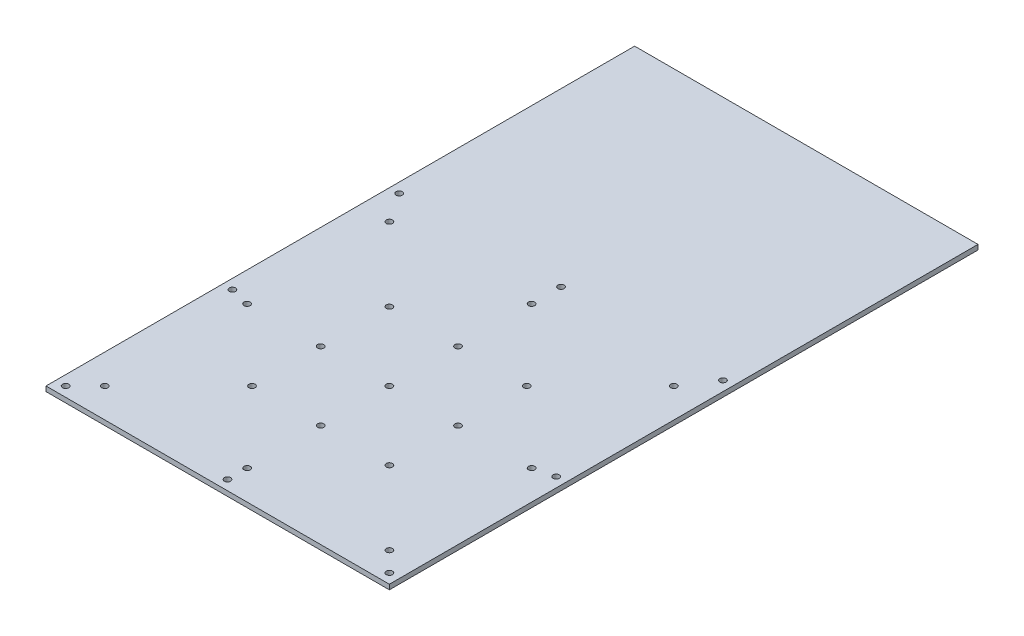
ISO-10303-21;
HEADER;
FILE_DESCRIPTION(('STEP AP214'),'2;1');
FILE_NAME('part.step','',(''),(''),'','','');
FILE_SCHEMA(('AUTOMOTIVE_DESIGN { 1 0 10303 214 1 1 1 1 }'));
ENDSEC;
DATA;
#1=APPLICATION_CONTEXT('core data for automotive mechanical design processes');
#2=APPLICATION_PROTOCOL_DEFINITION('international standard','automotive_design',2000,#1);
#3=PRODUCT_CONTEXT('',#1,'mechanical');
#4=PRODUCT('Part','Part','',(#3));
#5=PRODUCT_RELATED_PRODUCT_CATEGORY('part','',(#4));
#6=PRODUCT_DEFINITION_FORMATION('','',#4);
#7=PRODUCT_DEFINITION_CONTEXT('part definition',#1,'design');
#8=PRODUCT_DEFINITION('design','',#6,#7);
#9=PRODUCT_DEFINITION_SHAPE('','',#8);
#10=(LENGTH_UNIT() NAMED_UNIT(*) SI_UNIT(.MILLI.,.METRE.));
#11=(NAMED_UNIT(*) PLANE_ANGLE_UNIT() SI_UNIT($,.RADIAN.));
#12=(NAMED_UNIT(*) SI_UNIT($,.STERADIAN.) SOLID_ANGLE_UNIT());
#13=UNCERTAINTY_MEASURE_WITH_UNIT(LENGTH_MEASURE(1.E-05),#10,'distance_accuracy_value','');
#14=(GEOMETRIC_REPRESENTATION_CONTEXT(3) GLOBAL_UNCERTAINTY_ASSIGNED_CONTEXT((#13)) GLOBAL_UNIT_ASSIGNED_CONTEXT((#10,
#11,#12)) REPRESENTATION_CONTEXT('',''));
#15=CARTESIAN_POINT('',(0.,0.,0.));
#16=DIRECTION('',(0.,0.,1.));
#17=DIRECTION('',(1.,0.,0.));
#18=AXIS2_PLACEMENT_3D('',#15,#16,#17);
#19=CARTESIAN_POINT('',(0.,5.,-600.));
#20=DIRECTION('',(0.,0.,1.));
#21=DIRECTION('',(1.,0.,0.));
#22=AXIS2_PLACEMENT_3D('',#19,#20,#21);
#23=PLANE('',#22);
#24=DIRECTION('',(-1.,0.,0.));
#25=VECTOR('',#24,1.);
#26=CARTESIAN_POINT('',(0.,0.,-600.));
#27=LINE('',#26,#25);
#28=CARTESIAN_POINT('',(350.,0.,-600.));
#29=VERTEX_POINT('',#28);
#30=CARTESIAN_POINT('',(0.,0.,-600.));
#31=VERTEX_POINT('',#30);
#32=EDGE_CURVE('E175',#29,#31,#27,.T.);
#33=ORIENTED_EDGE('',*,*,#32,.T.);
#34=DIRECTION('',(0.,-1.,0.));
#35=VECTOR('',#34,1.);
#36=CARTESIAN_POINT('',(0.,5.,-600.));
#37=LINE('',#36,#35);
#38=CARTESIAN_POINT('',(0.,5.,-600.));
#39=VERTEX_POINT('',#38);
#40=EDGE_CURVE('E11',#39,#31,#37,.T.);
#41=ORIENTED_EDGE('',*,*,#40,.F.);
#42=DIRECTION('',(-1.,0.,0.));
#43=VECTOR('',#42,1.);
#44=CARTESIAN_POINT('',(0.,5.,-600.));
#45=LINE('',#44,#43);
#46=CARTESIAN_POINT('',(350.,5.,-600.));
#47=VERTEX_POINT('',#46);
#48=EDGE_CURVE('E88',#47,#39,#45,.T.);
#49=ORIENTED_EDGE('',*,*,#48,.F.);
#50=DIRECTION('',(0.,-1.,0.));
#51=VECTOR('',#50,1.);
#52=CARTESIAN_POINT('',(350.,5.,-600.));
#53=LINE('',#52,#51);
#54=EDGE_CURVE('E126',#47,#29,#53,.T.);
#55=ORIENTED_EDGE('',*,*,#54,.T.);
#56=EDGE_LOOP('',(#33,#41,#49,#55));
#57=FACE_BOUND('',#56,.T.);
#58=ADVANCED_FACE('F35',(#57),#23,.F.);
#59=CARTESIAN_POINT('',(0.,5.,0.));
#60=DIRECTION('',(1.,0.,0.));
#61=DIRECTION('',(0.,0.,-1.));
#62=AXIS2_PLACEMENT_3D('',#59,#60,#61);
#63=PLANE('',#62);
#64=DIRECTION('',(0.,0.,1.));
#65=VECTOR('',#64,1.);
#66=CARTESIAN_POINT('',(0.,0.,0.));
#67=LINE('',#66,#65);
#68=CARTESIAN_POINT('',(0.,0.,0.));
#69=VERTEX_POINT('',#68);
#70=EDGE_CURVE('E92',#31,#69,#67,.T.);
#71=ORIENTED_EDGE('',*,*,#70,.T.);
#72=DIRECTION('',(0.,-1.,0.));
#73=VECTOR('',#72,1.);
#74=CARTESIAN_POINT('',(0.,5.,0.));
#75=LINE('',#74,#73);
#76=CARTESIAN_POINT('',(0.,5.,0.));
#77=VERTEX_POINT('',#76);
#78=EDGE_CURVE('E44',#77,#69,#75,.T.);
#79=ORIENTED_EDGE('',*,*,#78,.F.);
#80=DIRECTION('',(0.,0.,1.));
#81=VECTOR('',#80,1.);
#82=CARTESIAN_POINT('',(0.,5.,0.));
#83=LINE('',#82,#81);
#84=EDGE_CURVE('E82',#39,#77,#83,.T.);
#85=ORIENTED_EDGE('',*,*,#84,.F.);
#86=ORIENTED_EDGE('',*,*,#40,.T.);
#87=EDGE_LOOP('',(#71,#79,#85,#86));
#88=FACE_BOUND('',#87,.T.);
#89=ADVANCED_FACE('F91',(#88),#63,.F.);
#90=CARTESIAN_POINT('',(0.,5.,0.));
#91=DIRECTION('',(0.,0.,-1.));
#92=DIRECTION('',(-1.,0.,0.));
#93=AXIS2_PLACEMENT_3D('',#90,#91,#92);
#94=PLANE('',#93);
#95=DIRECTION('',(1.,0.,0.));
#96=VECTOR('',#95,1.);
#97=CARTESIAN_POINT('',(0.,0.,0.));
#98=LINE('',#97,#96);
#99=CARTESIAN_POINT('',(350.,0.,0.));
#100=VERTEX_POINT('',#99);
#101=EDGE_CURVE('E69',#69,#100,#98,.T.);
#102=ORIENTED_EDGE('',*,*,#101,.T.);
#103=DIRECTION('',(0.,-1.,0.));
#104=VECTOR('',#103,1.);
#105=CARTESIAN_POINT('',(350.,5.,0.));
#106=LINE('',#105,#104);
#107=CARTESIAN_POINT('',(350.,5.,0.));
#108=VERTEX_POINT('',#107);
#109=EDGE_CURVE('E93',#108,#100,#106,.T.);
#110=ORIENTED_EDGE('',*,*,#109,.F.);
#111=DIRECTION('',(1.,0.,0.));
#112=VECTOR('',#111,1.);
#113=CARTESIAN_POINT('',(0.,5.,0.));
#114=LINE('',#113,#112);
#115=EDGE_CURVE('E86',#77,#108,#114,.T.);
#116=ORIENTED_EDGE('',*,*,#115,.F.);
#117=ORIENTED_EDGE('',*,*,#78,.T.);
#118=EDGE_LOOP('',(#102,#110,#116,#117));
#119=FACE_BOUND('',#118,.T.);
#120=ADVANCED_FACE('F94',(#119),#94,.F.);
#121=CARTESIAN_POINT('',(175.,5.,-245.));
#122=DIRECTION('',(0.,-1.,0.));
#123=DIRECTION('',(0.,0.,-1.));
#124=AXIS2_PLACEMENT_3D('',#121,#122,#123);
#125=CYLINDRICAL_SURFACE('',#124,3.17499999999997);
#126=CARTESIAN_POINT('',(175.,5.,-245.));
#127=DIRECTION('',(0.,1.,0.));
#128=DIRECTION('',(0.,0.,1.));
#129=AXIS2_PLACEMENT_3D('',#126,#127,#128);
#130=CIRCLE('',#129,3.17499999999997);
#131=CARTESIAN_POINT('',(175.,5.,-241.825));
#132=VERTEX_POINT('',#131);
#133=EDGE_CURVE('E120',#132,#132,#130,.T.);
#134=ORIENTED_EDGE('',*,*,#133,.T.);
#135=EDGE_LOOP('',(#134));
#136=FACE_BOUND('',#135,.T.);
#137=CARTESIAN_POINT('',(175.,0.,-245.));
#138=DIRECTION('',(0.,1.,0.));
#139=DIRECTION('',(0.,0.,1.));
#140=AXIS2_PLACEMENT_3D('',#137,#138,#139);
#141=CIRCLE('',#140,3.17499999999997);
#142=CARTESIAN_POINT('',(175.,0.,-241.825));
#143=VERTEX_POINT('',#142);
#144=EDGE_CURVE('E202',#143,#143,#141,.T.);
#145=ORIENTED_EDGE('',*,*,#144,.F.);
#146=EDGE_LOOP('',(#145));
#147=FACE_BOUND('',#146,.T.);
#148=ADVANCED_FACE('F428',(#136,#147),#125,.F.);
#149=CARTESIAN_POINT('',(245.,5.,-245.));
#150=DIRECTION('',(0.,-1.,0.));
#151=DIRECTION('',(0.,0.,-1.));
#152=AXIS2_PLACEMENT_3D('',#149,#150,#151);
#153=CYLINDRICAL_SURFACE('',#152,3.17499999999997);
#154=CARTESIAN_POINT('',(245.,5.,-245.));
#155=DIRECTION('',(0.,1.,0.));
#156=DIRECTION('',(0.,0.,1.));
#157=AXIS2_PLACEMENT_3D('',#154,#155,#156);
#158=CIRCLE('',#157,3.17499999999997);
#159=CARTESIAN_POINT('',(245.,5.,-241.825));
#160=VERTEX_POINT('',#159);
#161=EDGE_CURVE('E117',#160,#160,#158,.T.);
#162=ORIENTED_EDGE('',*,*,#161,.T.);
#163=EDGE_LOOP('',(#162));
#164=FACE_BOUND('',#163,.T.);
#165=CARTESIAN_POINT('',(245.,0.,-245.));
#166=DIRECTION('',(0.,1.,0.));
#167=DIRECTION('',(0.,0.,1.));
#168=AXIS2_PLACEMENT_3D('',#165,#166,#167);
#169=CIRCLE('',#168,3.17499999999997);
#170=CARTESIAN_POINT('',(245.,0.,-241.825));
#171=VERTEX_POINT('',#170);
#172=EDGE_CURVE('E199',#171,#171,#169,.T.);
#173=ORIENTED_EDGE('',*,*,#172,.F.);
#174=EDGE_LOOP('',(#173));
#175=FACE_BOUND('',#174,.T.);
#176=ADVANCED_FACE('F431',(#164,#175),#153,.F.);
#177=CARTESIAN_POINT('',(175.,5.,-175.));
#178=DIRECTION('',(0.,-1.,0.));
#179=DIRECTION('',(0.,0.,-1.));
#180=AXIS2_PLACEMENT_3D('',#177,#178,#179);
#181=CYLINDRICAL_SURFACE('',#180,3.175);
#182=CARTESIAN_POINT('',(175.,5.,-175.));
#183=DIRECTION('',(0.,1.,0.));
#184=DIRECTION('',(0.,0.,1.));
#185=AXIS2_PLACEMENT_3D('',#182,#183,#184);
#186=CIRCLE('',#185,3.175);
#187=CARTESIAN_POINT('',(175.,5.,-171.825));
#188=VERTEX_POINT('',#187);
#189=EDGE_CURVE('E114',#188,#188,#186,.T.);
#190=ORIENTED_EDGE('',*,*,#189,.T.);
#191=EDGE_LOOP('',(#190));
#192=FACE_BOUND('',#191,.T.);
#193=CARTESIAN_POINT('',(175.,0.,-175.));
#194=DIRECTION('',(0.,1.,0.));
#195=DIRECTION('',(0.,0.,1.));
#196=AXIS2_PLACEMENT_3D('',#193,#194,#195);
#197=CIRCLE('',#196,3.175);
#198=CARTESIAN_POINT('',(175.,0.,-171.825));
#199=VERTEX_POINT('',#198);
#200=EDGE_CURVE('E196',#199,#199,#197,.T.);
#201=ORIENTED_EDGE('',*,*,#200,.F.);
#202=EDGE_LOOP('',(#201));
#203=FACE_BOUND('',#202,.T.);
#204=ADVANCED_FACE('F435',(#192,#203),#181,.F.);
#205=CARTESIAN_POINT('',(245.,5.,-175.));
#206=DIRECTION('',(0.,-1.,0.));
#207=DIRECTION('',(0.,0.,-1.));
#208=AXIS2_PLACEMENT_3D('',#205,#206,#207);
#209=CYLINDRICAL_SURFACE('',#208,3.17499999999997);
#210=CARTESIAN_POINT('',(245.,5.,-175.));
#211=DIRECTION('',(0.,1.,0.));
#212=DIRECTION('',(0.,0.,1.));
#213=AXIS2_PLACEMENT_3D('',#210,#211,#212);
#214=CIRCLE('',#213,3.17499999999997);
#215=CARTESIAN_POINT('',(245.,5.,-171.825));
#216=VERTEX_POINT('',#215);
#217=EDGE_CURVE('E111',#216,#216,#214,.T.);
#218=ORIENTED_EDGE('',*,*,#217,.T.);
#219=EDGE_LOOP('',(#218));
#220=FACE_BOUND('',#219,.T.);
#221=CARTESIAN_POINT('',(245.,0.,-175.));
#222=DIRECTION('',(0.,1.,0.));
#223=DIRECTION('',(0.,0.,1.));
#224=AXIS2_PLACEMENT_3D('',#221,#222,#223);
#225=CIRCLE('',#224,3.17499999999997);
#226=CARTESIAN_POINT('',(245.,0.,-171.825));
#227=VERTEX_POINT('',#226);
#228=EDGE_CURVE('E193',#227,#227,#225,.T.);
#229=ORIENTED_EDGE('',*,*,#228,.F.);
#230=EDGE_LOOP('',(#229));
#231=FACE_BOUND('',#230,.T.);
#232=ADVANCED_FACE('F439',(#220,#231),#209,.F.);
#233=CARTESIAN_POINT('',(105.,5.,-175.));
#234=DIRECTION('',(0.,-1.,0.));
#235=DIRECTION('',(0.,0.,-1.));
#236=AXIS2_PLACEMENT_3D('',#233,#234,#235);
#237=CYLINDRICAL_SURFACE('',#236,3.17499999999997);
#238=CARTESIAN_POINT('',(105.,5.,-175.));
#239=DIRECTION('',(0.,1.,0.));
#240=DIRECTION('',(0.,0.,1.));
#241=AXIS2_PLACEMENT_3D('',#238,#239,#240);
#242=CIRCLE('',#241,3.17499999999997);
#243=CARTESIAN_POINT('',(105.,5.,-171.825));
#244=VERTEX_POINT('',#243);
#245=EDGE_CURVE('E108',#244,#244,#242,.T.);
#246=ORIENTED_EDGE('',*,*,#245,.T.);
#247=EDGE_LOOP('',(#246));
#248=FACE_BOUND('',#247,.T.);
#249=CARTESIAN_POINT('',(105.,0.,-175.));
#250=DIRECTION('',(0.,1.,0.));
#251=DIRECTION('',(0.,0.,1.));
#252=AXIS2_PLACEMENT_3D('',#249,#250,#251);
#253=CIRCLE('',#252,3.17499999999997);
#254=CARTESIAN_POINT('',(105.,0.,-171.825));
#255=VERTEX_POINT('',#254);
#256=EDGE_CURVE('E190',#255,#255,#253,.T.);
#257=ORIENTED_EDGE('',*,*,#256,.F.);
#258=EDGE_LOOP('',(#257));
#259=FACE_BOUND('',#258,.T.);
#260=ADVANCED_FACE('F443',(#248,#259),#237,.F.);
#261=CARTESIAN_POINT('',(105.,5.,-105.));
#262=DIRECTION('',(0.,-1.,0.));
#263=DIRECTION('',(0.,0.,-1.));
#264=AXIS2_PLACEMENT_3D('',#261,#262,#263);
#265=CYLINDRICAL_SURFACE('',#264,3.17499999999997);
#266=CARTESIAN_POINT('',(105.,5.,-105.));
#267=DIRECTION('',(0.,1.,0.));
#268=DIRECTION('',(0.,0.,1.));
#269=AXIS2_PLACEMENT_3D('',#266,#267,#268);
#270=CIRCLE('',#269,3.17499999999997);
#271=CARTESIAN_POINT('',(105.,5.,-101.825));
#272=VERTEX_POINT('',#271);
#273=EDGE_CURVE('E105',#272,#272,#270,.T.);
#274=ORIENTED_EDGE('',*,*,#273,.T.);
#275=EDGE_LOOP('',(#274));
#276=FACE_BOUND('',#275,.T.);
#277=CARTESIAN_POINT('',(105.,0.,-105.));
#278=DIRECTION('',(0.,1.,0.));
#279=DIRECTION('',(0.,0.,1.));
#280=AXIS2_PLACEMENT_3D('',#277,#278,#279);
#281=CIRCLE('',#280,3.17499999999997);
#282=CARTESIAN_POINT('',(105.,0.,-101.825));
#283=VERTEX_POINT('',#282);
#284=EDGE_CURVE('E187',#283,#283,#281,.T.);
#285=ORIENTED_EDGE('',*,*,#284,.F.);
#286=EDGE_LOOP('',(#285));
#287=FACE_BOUND('',#286,.T.);
#288=ADVANCED_FACE('F447',(#276,#287),#265,.F.);
#289=CARTESIAN_POINT('',(175.,5.,-105.));
#290=DIRECTION('',(0.,-1.,0.));
#291=DIRECTION('',(0.,0.,-1.));
#292=AXIS2_PLACEMENT_3D('',#289,#290,#291);
#293=CYLINDRICAL_SURFACE('',#292,3.17499999999997);
#294=CARTESIAN_POINT('',(175.,5.,-105.));
#295=DIRECTION('',(0.,1.,0.));
#296=DIRECTION('',(0.,0.,1.));
#297=AXIS2_PLACEMENT_3D('',#294,#295,#296);
#298=CIRCLE('',#297,3.17499999999997);
#299=CARTESIAN_POINT('',(175.,5.,-101.825));
#300=VERTEX_POINT('',#299);
#301=EDGE_CURVE('E102',#300,#300,#298,.T.);
#302=ORIENTED_EDGE('',*,*,#301,.T.);
#303=EDGE_LOOP('',(#302));
#304=FACE_BOUND('',#303,.T.);
#305=CARTESIAN_POINT('',(175.,0.,-105.));
#306=DIRECTION('',(0.,1.,0.));
#307=DIRECTION('',(0.,0.,1.));
#308=AXIS2_PLACEMENT_3D('',#305,#306,#307);
#309=CIRCLE('',#308,3.17499999999997);
#310=CARTESIAN_POINT('',(175.,0.,-101.825));
#311=VERTEX_POINT('',#310);
#312=EDGE_CURVE('E184',#311,#311,#309,.T.);
#313=ORIENTED_EDGE('',*,*,#312,.F.);
#314=EDGE_LOOP('',(#313));
#315=FACE_BOUND('',#314,.T.);
#316=ADVANCED_FACE('F451',(#304,#315),#293,.F.);
#317=CARTESIAN_POINT('',(245.,5.,-105.));
#318=DIRECTION('',(0.,-1.,0.));
#319=DIRECTION('',(0.,0.,-1.));
#320=AXIS2_PLACEMENT_3D('',#317,#318,#319);
#321=CYLINDRICAL_SURFACE('',#320,3.17499999999997);
#322=CARTESIAN_POINT('',(245.,5.,-105.));
#323=DIRECTION('',(0.,1.,0.));
#324=DIRECTION('',(0.,0.,1.));
#325=AXIS2_PLACEMENT_3D('',#322,#323,#324);
#326=CIRCLE('',#325,3.17499999999997);
#327=CARTESIAN_POINT('',(245.,5.,-101.825));
#328=VERTEX_POINT('',#327);
#329=EDGE_CURVE('E96',#328,#328,#326,.T.);
#330=ORIENTED_EDGE('',*,*,#329,.T.);
#331=EDGE_LOOP('',(#330));
#332=FACE_BOUND('',#331,.T.);
#333=CARTESIAN_POINT('',(245.,0.,-105.));
#334=DIRECTION('',(0.,1.,0.));
#335=DIRECTION('',(0.,0.,1.));
#336=AXIS2_PLACEMENT_3D('',#333,#334,#335);
#337=CIRCLE('',#336,3.17499999999997);
#338=CARTESIAN_POINT('',(245.,0.,-101.825));
#339=VERTEX_POINT('',#338);
#340=EDGE_CURVE('E181',#339,#339,#337,.T.);
#341=ORIENTED_EDGE('',*,*,#340,.F.);
#342=EDGE_LOOP('',(#341));
#343=FACE_BOUND('',#342,.T.);
#344=ADVANCED_FACE('F455',(#332,#343),#321,.F.);
#345=CARTESIAN_POINT('',(350.,5.,0.));
#346=DIRECTION('',(-1.,0.,0.));
#347=DIRECTION('',(0.,0.,1.));
#348=AXIS2_PLACEMENT_3D('',#345,#346,#347);
#349=PLANE('',#348);
#350=DIRECTION('',(0.,0.,-1.));
#351=VECTOR('',#350,1.);
#352=CARTESIAN_POINT('',(350.,0.,0.));
#353=LINE('',#352,#351);
#354=EDGE_CURVE('E75',#100,#29,#353,.T.);
#355=ORIENTED_EDGE('',*,*,#354,.T.);
#356=ORIENTED_EDGE('',*,*,#54,.F.);
#357=DIRECTION('',(0.,0.,-1.));
#358=VECTOR('',#357,1.);
#359=CARTESIAN_POINT('',(350.,5.,0.));
#360=LINE('',#359,#358);
#361=EDGE_CURVE('E52',#108,#47,#360,.T.);
#362=ORIENTED_EDGE('',*,*,#361,.F.);
#363=ORIENTED_EDGE('',*,*,#109,.T.);
#364=EDGE_LOOP('',(#355,#356,#362,#363));
#365=FACE_BOUND('',#364,.T.);
#366=ADVANCED_FACE('F210',(#365),#349,.F.);
#367=CARTESIAN_POINT('',(10.0000000000001,5.,-9.99999999999996));
#368=DIRECTION('',(0.,-1.,0.));
#369=DIRECTION('',(0.,0.,-1.));
#370=AXIS2_PLACEMENT_3D('',#367,#368,#369);
#371=CYLINDRICAL_SURFACE('',#370,3.175);
#372=CARTESIAN_POINT('',(10.0000000000001,5.,-9.99999999999996));
#373=DIRECTION('',(0.,1.,0.));
#374=DIRECTION('',(0.,0.,1.));
#375=AXIS2_PLACEMENT_3D('',#372,#373,#374);
#376=CIRCLE('',#375,3.175);
#377=CARTESIAN_POINT('',(10.0000000000001,5.,-6.82499999999996));
#378=VERTEX_POINT('',#377);
#379=EDGE_CURVE('E216',#378,#378,#376,.T.);
#380=ORIENTED_EDGE('',*,*,#379,.T.);
#381=EDGE_LOOP('',(#380));
#382=FACE_BOUND('',#381,.T.);
#383=CARTESIAN_POINT('',(10.0000000000001,0.,-9.99999999999996));
#384=DIRECTION('',(0.,1.,0.));
#385=DIRECTION('',(0.,0.,1.));
#386=AXIS2_PLACEMENT_3D('',#383,#384,#385);
#387=CIRCLE('',#386,3.175);
#388=CARTESIAN_POINT('',(10.0000000000001,0.,-6.82499999999996));
#389=VERTEX_POINT('',#388);
#390=EDGE_CURVE('E172',#389,#389,#387,.T.);
#391=ORIENTED_EDGE('',*,*,#390,.F.);
#392=EDGE_LOOP('',(#391));
#393=FACE_BOUND('',#392,.T.);
#394=ADVANCED_FACE('F301',(#382,#393),#371,.F.);
#395=CARTESIAN_POINT('',(175.,5.,-9.99999999999998));
#396=DIRECTION('',(0.,-1.,0.));
#397=DIRECTION('',(0.,0.,-1.));
#398=AXIS2_PLACEMENT_3D('',#395,#396,#397);
#399=CYLINDRICAL_SURFACE('',#398,3.175);
#400=CARTESIAN_POINT('',(175.,5.,-9.99999999999998));
#401=DIRECTION('',(0.,1.,0.));
#402=DIRECTION('',(0.,0.,1.));
#403=AXIS2_PLACEMENT_3D('',#400,#401,#402);
#404=CIRCLE('',#403,3.175);
#405=CARTESIAN_POINT('',(175.,5.,-6.82499999999998));
#406=VERTEX_POINT('',#405);
#407=EDGE_CURVE('E218',#406,#406,#404,.T.);
#408=ORIENTED_EDGE('',*,*,#407,.T.);
#409=EDGE_LOOP('',(#408));
#410=FACE_BOUND('',#409,.T.);
#411=CARTESIAN_POINT('',(175.,0.,-9.99999999999998));
#412=DIRECTION('',(0.,1.,0.));
#413=DIRECTION('',(0.,0.,1.));
#414=AXIS2_PLACEMENT_3D('',#411,#412,#413);
#415=CIRCLE('',#414,3.175);
#416=CARTESIAN_POINT('',(175.,0.,-6.82499999999998));
#417=VERTEX_POINT('',#416);
#418=EDGE_CURVE('E169',#417,#417,#415,.T.);
#419=ORIENTED_EDGE('',*,*,#418,.F.);
#420=EDGE_LOOP('',(#419));
#421=FACE_BOUND('',#420,.T.);
#422=ADVANCED_FACE('F304',(#410,#421),#399,.F.);
#423=CARTESIAN_POINT('',(340.,5.,-10.));
#424=DIRECTION('',(0.,-1.,0.));
#425=DIRECTION('',(0.,0.,-1.));
#426=AXIS2_PLACEMENT_3D('',#423,#424,#425);
#427=CYLINDRICAL_SURFACE('',#426,3.17499999999997);
#428=CARTESIAN_POINT('',(340.,5.,-10.));
#429=DIRECTION('',(0.,1.,0.));
#430=DIRECTION('',(0.,0.,1.));
#431=AXIS2_PLACEMENT_3D('',#428,#429,#430);
#432=CIRCLE('',#431,3.17499999999997);
#433=CARTESIAN_POINT('',(340.,5.,-6.82500000000003));
#434=VERTEX_POINT('',#433);
#435=EDGE_CURVE('E223',#434,#434,#432,.T.);
#436=ORIENTED_EDGE('',*,*,#435,.T.);
#437=EDGE_LOOP('',(#436));
#438=FACE_BOUND('',#437,.T.);
#439=CARTESIAN_POINT('',(340.,0.,-10.));
#440=DIRECTION('',(0.,1.,0.));
#441=DIRECTION('',(0.,0.,1.));
#442=AXIS2_PLACEMENT_3D('',#439,#440,#441);
#443=CIRCLE('',#442,3.17499999999997);
#444=CARTESIAN_POINT('',(340.,0.,-6.82500000000003));
#445=VERTEX_POINT('',#444);
#446=EDGE_CURVE('E166',#445,#445,#443,.T.);
#447=ORIENTED_EDGE('',*,*,#446,.F.);
#448=EDGE_LOOP('',(#447));
#449=FACE_BOUND('',#448,.T.);
#450=ADVANCED_FACE('F325',(#438,#449),#427,.F.);
#451=CARTESIAN_POINT('',(340.,5.,-350.));
#452=DIRECTION('',(0.,-1.,0.));
#453=DIRECTION('',(0.,0.,-1.));
#454=AXIS2_PLACEMENT_3D('',#451,#452,#453);
#455=CYLINDRICAL_SURFACE('',#454,3.17499999999997);
#456=CARTESIAN_POINT('',(340.,5.,-350.));
#457=DIRECTION('',(0.,1.,0.));
#458=DIRECTION('',(0.,0.,1.));
#459=AXIS2_PLACEMENT_3D('',#456,#457,#458);
#460=CIRCLE('',#459,3.17499999999997);
#461=CARTESIAN_POINT('',(340.,5.,-346.825));
#462=VERTEX_POINT('',#461);
#463=EDGE_CURVE('E226',#462,#462,#460,.T.);
#464=ORIENTED_EDGE('',*,*,#463,.T.);
#465=EDGE_LOOP('',(#464));
#466=FACE_BOUND('',#465,.T.);
#467=CARTESIAN_POINT('',(340.,0.,-350.));
#468=DIRECTION('',(0.,1.,0.));
#469=DIRECTION('',(0.,0.,1.));
#470=AXIS2_PLACEMENT_3D('',#467,#468,#469);
#471=CIRCLE('',#470,3.17499999999997);
#472=CARTESIAN_POINT('',(340.,0.,-346.825));
#473=VERTEX_POINT('',#472);
#474=EDGE_CURVE('E163',#473,#473,#471,.T.);
#475=ORIENTED_EDGE('',*,*,#474,.F.);
#476=EDGE_LOOP('',(#475));
#477=FACE_BOUND('',#476,.T.);
#478=ADVANCED_FACE('F329',(#466,#477),#455,.F.);
#479=CARTESIAN_POINT('',(340.,5.,-180.));
#480=DIRECTION('',(0.,-1.,0.));
#481=DIRECTION('',(0.,0.,-1.));
#482=AXIS2_PLACEMENT_3D('',#479,#480,#481);
#483=CYLINDRICAL_SURFACE('',#482,3.17499999999997);
#484=CARTESIAN_POINT('',(340.,5.,-180.));
#485=DIRECTION('',(0.,1.,0.));
#486=DIRECTION('',(0.,0.,1.));
#487=AXIS2_PLACEMENT_3D('',#484,#485,#486);
#488=CIRCLE('',#487,3.17499999999997);
#489=CARTESIAN_POINT('',(340.,5.,-176.825));
#490=VERTEX_POINT('',#489);
#491=EDGE_CURVE('E229',#490,#490,#488,.T.);
#492=ORIENTED_EDGE('',*,*,#491,.T.);
#493=EDGE_LOOP('',(#492));
#494=FACE_BOUND('',#493,.T.);
#495=CARTESIAN_POINT('',(340.,0.,-180.));
#496=DIRECTION('',(0.,1.,0.));
#497=DIRECTION('',(0.,0.,1.));
#498=AXIS2_PLACEMENT_3D('',#495,#496,#497);
#499=CIRCLE('',#498,3.17499999999997);
#500=CARTESIAN_POINT('',(340.,0.,-176.825));
#501=VERTEX_POINT('',#500);
#502=EDGE_CURVE('E160',#501,#501,#499,.T.);
#503=ORIENTED_EDGE('',*,*,#502,.F.);
#504=EDGE_LOOP('',(#503));
#505=FACE_BOUND('',#504,.T.);
#506=ADVANCED_FACE('F333',(#494,#505),#483,.F.);
#507=CARTESIAN_POINT('',(10.0000000000001,5.,-180.));
#508=DIRECTION('',(0.,-1.,0.));
#509=DIRECTION('',(0.,0.,-1.));
#510=AXIS2_PLACEMENT_3D('',#507,#508,#509);
#511=CYLINDRICAL_SURFACE('',#510,3.175);
#512=CARTESIAN_POINT('',(10.0000000000001,5.,-180.));
#513=DIRECTION('',(0.,1.,0.));
#514=DIRECTION('',(0.,0.,1.));
#515=AXIS2_PLACEMENT_3D('',#512,#513,#514);
#516=CIRCLE('',#515,3.175);
#517=CARTESIAN_POINT('',(10.0000000000001,5.,-176.825));
#518=VERTEX_POINT('',#517);
#519=EDGE_CURVE('E232',#518,#518,#516,.T.);
#520=ORIENTED_EDGE('',*,*,#519,.T.);
#521=EDGE_LOOP('',(#520));
#522=FACE_BOUND('',#521,.T.);
#523=CARTESIAN_POINT('',(10.0000000000001,0.,-180.));
#524=DIRECTION('',(0.,1.,0.));
#525=DIRECTION('',(0.,0.,1.));
#526=AXIS2_PLACEMENT_3D('',#523,#524,#525);
#527=CIRCLE('',#526,3.175);
#528=CARTESIAN_POINT('',(10.0000000000001,0.,-176.825));
#529=VERTEX_POINT('',#528);
#530=EDGE_CURVE('E157',#529,#529,#527,.T.);
#531=ORIENTED_EDGE('',*,*,#530,.F.);
#532=EDGE_LOOP('',(#531));
#533=FACE_BOUND('',#532,.T.);
#534=ADVANCED_FACE('F337',(#522,#533),#511,.F.);
#535=CARTESIAN_POINT('',(10.0000000000001,5.,-350.));
#536=DIRECTION('',(0.,-1.,0.));
#537=DIRECTION('',(0.,0.,-1.));
#538=AXIS2_PLACEMENT_3D('',#535,#536,#537);
#539=CYLINDRICAL_SURFACE('',#538,3.175);
#540=CARTESIAN_POINT('',(10.0000000000001,5.,-350.));
#541=DIRECTION('',(0.,1.,0.));
#542=DIRECTION('',(0.,0.,1.));
#543=AXIS2_PLACEMENT_3D('',#540,#541,#542);
#544=CIRCLE('',#543,3.175);
#545=CARTESIAN_POINT('',(10.0000000000001,5.,-346.825));
#546=VERTEX_POINT('',#545);
#547=EDGE_CURVE('E235',#546,#546,#544,.T.);
#548=ORIENTED_EDGE('',*,*,#547,.T.);
#549=EDGE_LOOP('',(#548));
#550=FACE_BOUND('',#549,.T.);
#551=CARTESIAN_POINT('',(10.0000000000001,0.,-350.));
#552=DIRECTION('',(0.,1.,0.));
#553=DIRECTION('',(0.,0.,1.));
#554=AXIS2_PLACEMENT_3D('',#551,#552,#553);
#555=CIRCLE('',#554,3.175);
#556=CARTESIAN_POINT('',(10.0000000000001,0.,-346.825));
#557=VERTEX_POINT('',#556);
#558=EDGE_CURVE('E154',#557,#557,#555,.T.);
#559=ORIENTED_EDGE('',*,*,#558,.F.);
#560=EDGE_LOOP('',(#559));
#561=FACE_BOUND('',#560,.T.);
#562=ADVANCED_FACE('F341',(#550,#561),#539,.F.);
#563=CARTESIAN_POINT('',(175.,5.,-350.));
#564=DIRECTION('',(0.,-1.,0.));
#565=DIRECTION('',(0.,0.,-1.));
#566=AXIS2_PLACEMENT_3D('',#563,#564,#565);
#567=CYLINDRICAL_SURFACE('',#566,3.175);
#568=CARTESIAN_POINT('',(175.,5.,-350.));
#569=DIRECTION('',(0.,1.,0.));
#570=DIRECTION('',(0.,0.,1.));
#571=AXIS2_PLACEMENT_3D('',#568,#569,#570);
#572=CIRCLE('',#571,3.175);
#573=CARTESIAN_POINT('',(175.,5.,-346.825));
#574=VERTEX_POINT('',#573);
#575=EDGE_CURVE('E238',#574,#574,#572,.T.);
#576=ORIENTED_EDGE('',*,*,#575,.T.);
#577=EDGE_LOOP('',(#576));
#578=FACE_BOUND('',#577,.T.);
#579=CARTESIAN_POINT('',(175.,0.,-350.));
#580=DIRECTION('',(0.,1.,0.));
#581=DIRECTION('',(0.,0.,1.));
#582=AXIS2_PLACEMENT_3D('',#579,#580,#581);
#583=CIRCLE('',#582,3.175);
#584=CARTESIAN_POINT('',(175.,0.,-346.825));
#585=VERTEX_POINT('',#584);
#586=EDGE_CURVE('E151',#585,#585,#583,.T.);
#587=ORIENTED_EDGE('',*,*,#586,.F.);
#588=EDGE_LOOP('',(#587));
#589=FACE_BOUND('',#588,.T.);
#590=ADVANCED_FACE('F345',(#578,#589),#567,.F.);
#591=CARTESIAN_POINT('',(320.,5.,-320.));
#592=DIRECTION('',(0.,-1.,0.));
#593=DIRECTION('',(0.,0.,-1.));
#594=AXIS2_PLACEMENT_3D('',#591,#592,#593);
#595=CYLINDRICAL_SURFACE('',#594,3.17499999999997);
#596=CARTESIAN_POINT('',(320.,5.,-320.));
#597=DIRECTION('',(0.,1.,0.));
#598=DIRECTION('',(0.,0.,1.));
#599=AXIS2_PLACEMENT_3D('',#596,#597,#598);
#600=CIRCLE('',#599,3.17499999999997);
#601=CARTESIAN_POINT('',(320.,5.,-316.825));
#602=VERTEX_POINT('',#601);
#603=EDGE_CURVE('E241',#602,#602,#600,.T.);
#604=ORIENTED_EDGE('',*,*,#603,.T.);
#605=EDGE_LOOP('',(#604));
#606=FACE_BOUND('',#605,.T.);
#607=CARTESIAN_POINT('',(320.,0.,-320.));
#608=DIRECTION('',(0.,1.,0.));
#609=DIRECTION('',(0.,0.,1.));
#610=AXIS2_PLACEMENT_3D('',#607,#608,#609);
#611=CIRCLE('',#610,3.17499999999997);
#612=CARTESIAN_POINT('',(320.,0.,-316.825));
#613=VERTEX_POINT('',#612);
#614=EDGE_CURVE('E148',#613,#613,#611,.T.);
#615=ORIENTED_EDGE('',*,*,#614,.F.);
#616=EDGE_LOOP('',(#615));
#617=FACE_BOUND('',#616,.T.);
#618=ADVANCED_FACE('F349',(#606,#617),#595,.F.);
#619=CARTESIAN_POINT('',(175.,5.,-320.));
#620=DIRECTION('',(0.,-1.,0.));
#621=DIRECTION('',(0.,0.,-1.));
#622=AXIS2_PLACEMENT_3D('',#619,#620,#621);
#623=CYLINDRICAL_SURFACE('',#622,3.17499999999997);
#624=CARTESIAN_POINT('',(175.,5.,-320.));
#625=DIRECTION('',(0.,1.,0.));
#626=DIRECTION('',(0.,0.,1.));
#627=AXIS2_PLACEMENT_3D('',#624,#625,#626);
#628=CIRCLE('',#627,3.17499999999997);
#629=CARTESIAN_POINT('',(175.,5.,-316.825));
#630=VERTEX_POINT('',#629);
#631=EDGE_CURVE('E244',#630,#630,#628,.T.);
#632=ORIENTED_EDGE('',*,*,#631,.T.);
#633=EDGE_LOOP('',(#632));
#634=FACE_BOUND('',#633,.T.);
#635=CARTESIAN_POINT('',(175.,0.,-320.));
#636=DIRECTION('',(0.,1.,0.));
#637=DIRECTION('',(0.,0.,1.));
#638=AXIS2_PLACEMENT_3D('',#635,#636,#637);
#639=CIRCLE('',#638,3.17499999999997);
#640=CARTESIAN_POINT('',(175.,0.,-316.825));
#641=VERTEX_POINT('',#640);
#642=EDGE_CURVE('E145',#641,#641,#639,.T.);
#643=ORIENTED_EDGE('',*,*,#642,.F.);
#644=EDGE_LOOP('',(#643));
#645=FACE_BOUND('',#644,.T.);
#646=ADVANCED_FACE('F353',(#634,#645),#623,.F.);
#647=CARTESIAN_POINT('',(29.9999999999999,5.,-320.));
#648=DIRECTION('',(0.,-1.,0.));
#649=DIRECTION('',(0.,0.,-1.));
#650=AXIS2_PLACEMENT_3D('',#647,#648,#649);
#651=CYLINDRICAL_SURFACE('',#650,3.175);
#652=CARTESIAN_POINT('',(29.9999999999999,5.,-320.));
#653=DIRECTION('',(0.,1.,0.));
#654=DIRECTION('',(0.,0.,1.));
#655=AXIS2_PLACEMENT_3D('',#652,#653,#654);
#656=CIRCLE('',#655,3.175);
#657=CARTESIAN_POINT('',(29.9999999999999,5.,-316.825));
#658=VERTEX_POINT('',#657);
#659=EDGE_CURVE('E247',#658,#658,#656,.T.);
#660=ORIENTED_EDGE('',*,*,#659,.T.);
#661=EDGE_LOOP('',(#660));
#662=FACE_BOUND('',#661,.T.);
#663=CARTESIAN_POINT('',(29.9999999999999,0.,-320.));
#664=DIRECTION('',(0.,1.,0.));
#665=DIRECTION('',(0.,0.,1.));
#666=AXIS2_PLACEMENT_3D('',#663,#664,#665);
#667=CIRCLE('',#666,3.175);
#668=CARTESIAN_POINT('',(29.9999999999999,0.,-316.825));
#669=VERTEX_POINT('',#668);
#670=EDGE_CURVE('E142',#669,#669,#667,.T.);
#671=ORIENTED_EDGE('',*,*,#670,.F.);
#672=EDGE_LOOP('',(#671));
#673=FACE_BOUND('',#672,.T.);
#674=ADVANCED_FACE('F357',(#662,#673),#651,.F.);
#675=CARTESIAN_POINT('',(320.,5.,-175.));
#676=DIRECTION('',(0.,-1.,0.));
#677=DIRECTION('',(0.,0.,-1.));
#678=AXIS2_PLACEMENT_3D('',#675,#676,#677);
#679=CYLINDRICAL_SURFACE('',#678,3.17499999999997);
#680=CARTESIAN_POINT('',(320.,5.,-175.));
#681=DIRECTION('',(0.,1.,0.));
#682=DIRECTION('',(0.,0.,1.));
#683=AXIS2_PLACEMENT_3D('',#680,#681,#682);
#684=CIRCLE('',#683,3.17499999999997);
#685=CARTESIAN_POINT('',(320.,5.,-171.825));
#686=VERTEX_POINT('',#685);
#687=EDGE_CURVE('E250',#686,#686,#684,.T.);
#688=ORIENTED_EDGE('',*,*,#687,.T.);
#689=EDGE_LOOP('',(#688));
#690=FACE_BOUND('',#689,.T.);
#691=CARTESIAN_POINT('',(320.,0.,-175.));
#692=DIRECTION('',(0.,1.,0.));
#693=DIRECTION('',(0.,0.,1.));
#694=AXIS2_PLACEMENT_3D('',#691,#692,#693);
#695=CIRCLE('',#694,3.17499999999997);
#696=CARTESIAN_POINT('',(320.,0.,-171.825));
#697=VERTEX_POINT('',#696);
#698=EDGE_CURVE('E139',#697,#697,#695,.T.);
#699=ORIENTED_EDGE('',*,*,#698,.F.);
#700=EDGE_LOOP('',(#699));
#701=FACE_BOUND('',#700,.T.);
#702=ADVANCED_FACE('F361',(#690,#701),#679,.F.);
#703=CARTESIAN_POINT('',(29.9999999999999,5.,-175.));
#704=DIRECTION('',(0.,-1.,0.));
#705=DIRECTION('',(0.,0.,-1.));
#706=AXIS2_PLACEMENT_3D('',#703,#704,#705);
#707=CYLINDRICAL_SURFACE('',#706,3.17499999999997);
#708=CARTESIAN_POINT('',(29.9999999999999,5.,-175.));
#709=DIRECTION('',(0.,1.,0.));
#710=DIRECTION('',(0.,0.,1.));
#711=AXIS2_PLACEMENT_3D('',#708,#709,#710);
#712=CIRCLE('',#711,3.17499999999997);
#713=CARTESIAN_POINT('',(29.9999999999999,5.,-171.825));
#714=VERTEX_POINT('',#713);
#715=EDGE_CURVE('E253',#714,#714,#712,.T.);
#716=ORIENTED_EDGE('',*,*,#715,.T.);
#717=EDGE_LOOP('',(#716));
#718=FACE_BOUND('',#717,.T.);
#719=CARTESIAN_POINT('',(29.9999999999999,0.,-175.));
#720=DIRECTION('',(0.,1.,0.));
#721=DIRECTION('',(0.,0.,1.));
#722=AXIS2_PLACEMENT_3D('',#719,#720,#721);
#723=CIRCLE('',#722,3.17499999999997);
#724=CARTESIAN_POINT('',(29.9999999999999,0.,-171.825));
#725=VERTEX_POINT('',#724);
#726=EDGE_CURVE('E136',#725,#725,#723,.T.);
#727=ORIENTED_EDGE('',*,*,#726,.F.);
#728=EDGE_LOOP('',(#727));
#729=FACE_BOUND('',#728,.T.);
#730=ADVANCED_FACE('F365',(#718,#729),#707,.F.);
#731=CARTESIAN_POINT('',(320.,5.,-30.));
#732=DIRECTION('',(0.,-1.,0.));
#733=DIRECTION('',(0.,0.,-1.));
#734=AXIS2_PLACEMENT_3D('',#731,#732,#733);
#735=CYLINDRICAL_SURFACE('',#734,3.17499999999997);
#736=CARTESIAN_POINT('',(320.,5.,-30.));
#737=DIRECTION('',(0.,1.,0.));
#738=DIRECTION('',(0.,0.,1.));
#739=AXIS2_PLACEMENT_3D('',#736,#737,#738);
#740=CIRCLE('',#739,3.17499999999997);
#741=CARTESIAN_POINT('',(320.,5.,-26.825));
#742=VERTEX_POINT('',#741);
#743=EDGE_CURVE('E256',#742,#742,#740,.T.);
#744=ORIENTED_EDGE('',*,*,#743,.T.);
#745=EDGE_LOOP('',(#744));
#746=FACE_BOUND('',#745,.T.);
#747=CARTESIAN_POINT('',(320.,0.,-30.));
#748=DIRECTION('',(0.,1.,0.));
#749=DIRECTION('',(0.,0.,1.));
#750=AXIS2_PLACEMENT_3D('',#747,#748,#749);
#751=CIRCLE('',#750,3.17499999999997);
#752=CARTESIAN_POINT('',(320.,0.,-26.825));
#753=VERTEX_POINT('',#752);
#754=EDGE_CURVE('E133',#753,#753,#751,.T.);
#755=ORIENTED_EDGE('',*,*,#754,.F.);
#756=EDGE_LOOP('',(#755));
#757=FACE_BOUND('',#756,.T.);
#758=ADVANCED_FACE('F369',(#746,#757),#735,.F.);
#759=CARTESIAN_POINT('',(175.,5.,-30.));
#760=DIRECTION('',(0.,-1.,0.));
#761=DIRECTION('',(0.,0.,-1.));
#762=AXIS2_PLACEMENT_3D('',#759,#760,#761);
#763=CYLINDRICAL_SURFACE('',#762,3.17499999999997);
#764=CARTESIAN_POINT('',(175.,5.,-30.));
#765=DIRECTION('',(0.,1.,0.));
#766=DIRECTION('',(0.,0.,1.));
#767=AXIS2_PLACEMENT_3D('',#764,#765,#766);
#768=CIRCLE('',#767,3.17499999999997);
#769=CARTESIAN_POINT('',(175.,5.,-26.825));
#770=VERTEX_POINT('',#769);
#771=EDGE_CURVE('E259',#770,#770,#768,.T.);
#772=ORIENTED_EDGE('',*,*,#771,.T.);
#773=EDGE_LOOP('',(#772));
#774=FACE_BOUND('',#773,.T.);
#775=CARTESIAN_POINT('',(175.,0.,-30.));
#776=DIRECTION('',(0.,1.,0.));
#777=DIRECTION('',(0.,0.,1.));
#778=AXIS2_PLACEMENT_3D('',#775,#776,#777);
#779=CIRCLE('',#778,3.17499999999997);
#780=CARTESIAN_POINT('',(175.,0.,-26.825));
#781=VERTEX_POINT('',#780);
#782=EDGE_CURVE('E130',#781,#781,#779,.T.);
#783=ORIENTED_EDGE('',*,*,#782,.F.);
#784=EDGE_LOOP('',(#783));
#785=FACE_BOUND('',#784,.T.);
#786=ADVANCED_FACE('F372',(#774,#785),#763,.F.);
#787=CARTESIAN_POINT('',(30.,5.,-30.));
#788=DIRECTION('',(0.,-1.,0.));
#789=DIRECTION('',(0.,0.,-1.));
#790=AXIS2_PLACEMENT_3D('',#787,#788,#789);
#791=CYLINDRICAL_SURFACE('',#790,3.17499999999997);
#792=CARTESIAN_POINT('',(30.,5.,-30.));
#793=DIRECTION('',(0.,1.,0.));
#794=DIRECTION('',(0.,0.,1.));
#795=AXIS2_PLACEMENT_3D('',#792,#793,#794);
#796=CIRCLE('',#795,3.17499999999997);
#797=CARTESIAN_POINT('',(30.,5.,-26.825));
#798=VERTEX_POINT('',#797);
#799=EDGE_CURVE('E208',#798,#798,#796,.T.);
#800=ORIENTED_EDGE('',*,*,#799,.T.);
#801=EDGE_LOOP('',(#800));
#802=FACE_BOUND('',#801,.T.);
#803=CARTESIAN_POINT('',(30.,0.,-30.));
#804=DIRECTION('',(0.,1.,0.));
#805=DIRECTION('',(0.,0.,1.));
#806=AXIS2_PLACEMENT_3D('',#803,#804,#805);
#807=CIRCLE('',#806,3.17499999999997);
#808=CARTESIAN_POINT('',(30.,0.,-26.825));
#809=VERTEX_POINT('',#808);
#810=EDGE_CURVE('E127',#809,#809,#807,.T.);
#811=ORIENTED_EDGE('',*,*,#810,.F.);
#812=EDGE_LOOP('',(#811));
#813=FACE_BOUND('',#812,.T.);
#814=ADVANCED_FACE('F37',(#802,#813),#791,.F.);
#815=CARTESIAN_POINT('',(105.,5.,-245.));
#816=DIRECTION('',(0.,-1.,0.));
#817=DIRECTION('',(0.,0.,-1.));
#818=AXIS2_PLACEMENT_3D('',#815,#816,#817);
#819=CYLINDRICAL_SURFACE('',#818,3.175);
#820=CARTESIAN_POINT('',(105.,5.,-245.));
#821=DIRECTION('',(0.,1.,0.));
#822=DIRECTION('',(0.,0.,1.));
#823=AXIS2_PLACEMENT_3D('',#820,#821,#822);
#824=CIRCLE('',#823,3.175);
#825=CARTESIAN_POINT('',(105.,5.,-241.825));
#826=VERTEX_POINT('',#825);
#827=EDGE_CURVE('E123',#826,#826,#824,.T.);
#828=ORIENTED_EDGE('',*,*,#827,.T.);
#829=EDGE_LOOP('',(#828));
#830=FACE_BOUND('',#829,.T.);
#831=CARTESIAN_POINT('',(105.,0.,-245.));
#832=DIRECTION('',(0.,1.,0.));
#833=DIRECTION('',(0.,0.,1.));
#834=AXIS2_PLACEMENT_3D('',#831,#832,#833);
#835=CIRCLE('',#834,3.175);
#836=CARTESIAN_POINT('',(105.,0.,-241.825));
#837=VERTEX_POINT('',#836);
#838=EDGE_CURVE('E205',#837,#837,#835,.T.);
#839=ORIENTED_EDGE('',*,*,#838,.F.);
#840=EDGE_LOOP('',(#839));
#841=FACE_BOUND('',#840,.T.);
#842=ADVANCED_FACE('F269',(#830,#841),#819,.F.);
#843=CARTESIAN_POINT('',(0.,5.,0.));
#844=DIRECTION('',(0.,1.,0.));
#845=DIRECTION('',(0.,0.,1.));
#846=AXIS2_PLACEMENT_3D('',#843,#844,#845);
#847=PLANE('',#846);
#848=ORIENTED_EDGE('',*,*,#799,.F.);
#849=EDGE_LOOP('',(#848));
#850=FACE_BOUND('',#849,.T.);
#851=ORIENTED_EDGE('',*,*,#771,.F.);
#852=EDGE_LOOP('',(#851));
#853=FACE_BOUND('',#852,.T.);
#854=ORIENTED_EDGE('',*,*,#743,.F.);
#855=EDGE_LOOP('',(#854));
#856=FACE_BOUND('',#855,.T.);
#857=ORIENTED_EDGE('',*,*,#715,.F.);
#858=EDGE_LOOP('',(#857));
#859=FACE_BOUND('',#858,.T.);
#860=ORIENTED_EDGE('',*,*,#687,.F.);
#861=EDGE_LOOP('',(#860));
#862=FACE_BOUND('',#861,.T.);
#863=ORIENTED_EDGE('',*,*,#659,.F.);
#864=EDGE_LOOP('',(#863));
#865=FACE_BOUND('',#864,.T.);
#866=ORIENTED_EDGE('',*,*,#631,.F.);
#867=EDGE_LOOP('',(#866));
#868=FACE_BOUND('',#867,.T.);
#869=ORIENTED_EDGE('',*,*,#603,.F.);
#870=EDGE_LOOP('',(#869));
#871=FACE_BOUND('',#870,.T.);
#872=ORIENTED_EDGE('',*,*,#575,.F.);
#873=EDGE_LOOP('',(#872));
#874=FACE_BOUND('',#873,.T.);
#875=ORIENTED_EDGE('',*,*,#547,.F.);
#876=EDGE_LOOP('',(#875));
#877=FACE_BOUND('',#876,.T.);
#878=ORIENTED_EDGE('',*,*,#519,.F.);
#879=EDGE_LOOP('',(#878));
#880=FACE_BOUND('',#879,.T.);
#881=ORIENTED_EDGE('',*,*,#491,.F.);
#882=EDGE_LOOP('',(#881));
#883=FACE_BOUND('',#882,.T.);
#884=ORIENTED_EDGE('',*,*,#463,.F.);
#885=EDGE_LOOP('',(#884));
#886=FACE_BOUND('',#885,.T.);
#887=ORIENTED_EDGE('',*,*,#435,.F.);
#888=EDGE_LOOP('',(#887));
#889=FACE_BOUND('',#888,.T.);
#890=ORIENTED_EDGE('',*,*,#407,.F.);
#891=EDGE_LOOP('',(#890));
#892=FACE_BOUND('',#891,.T.);
#893=ORIENTED_EDGE('',*,*,#379,.F.);
#894=EDGE_LOOP('',(#893));
#895=FACE_BOUND('',#894,.T.);
#896=ORIENTED_EDGE('',*,*,#48,.T.);
#897=ORIENTED_EDGE('',*,*,#84,.T.);
#898=ORIENTED_EDGE('',*,*,#115,.T.);
#899=ORIENTED_EDGE('',*,*,#361,.T.);
#900=EDGE_LOOP('',(#896,#897,#898,#899));
#901=FACE_BOUND('',#900,.T.);
#902=ORIENTED_EDGE('',*,*,#329,.F.);
#903=EDGE_LOOP('',(#902));
#904=FACE_BOUND('',#903,.T.);
#905=ORIENTED_EDGE('',*,*,#301,.F.);
#906=EDGE_LOOP('',(#905));
#907=FACE_BOUND('',#906,.T.);
#908=ORIENTED_EDGE('',*,*,#273,.F.);
#909=EDGE_LOOP('',(#908));
#910=FACE_BOUND('',#909,.T.);
#911=ORIENTED_EDGE('',*,*,#245,.F.);
#912=EDGE_LOOP('',(#911));
#913=FACE_BOUND('',#912,.T.);
#914=ORIENTED_EDGE('',*,*,#217,.F.);
#915=EDGE_LOOP('',(#914));
#916=FACE_BOUND('',#915,.T.);
#917=ORIENTED_EDGE('',*,*,#189,.F.);
#918=EDGE_LOOP('',(#917));
#919=FACE_BOUND('',#918,.T.);
#920=ORIENTED_EDGE('',*,*,#161,.F.);
#921=EDGE_LOOP('',(#920));
#922=FACE_BOUND('',#921,.T.);
#923=ORIENTED_EDGE('',*,*,#133,.F.);
#924=EDGE_LOOP('',(#923));
#925=FACE_BOUND('',#924,.T.);
#926=ORIENTED_EDGE('',*,*,#827,.F.);
#927=EDGE_LOOP('',(#926));
#928=FACE_BOUND('',#927,.T.);
#929=ADVANCED_FACE('F83',(#850,#853,#856,#859,#862,#865,#868,#871,#874,#877,#880,#883,#886,#889,
#892,#895,#901,#904,#907,#910,#913,#916,#919,#922,#925,#928),#847,.T.);
#930=CARTESIAN_POINT('',(0.,0.,0.));
#931=DIRECTION('',(0.,1.,0.));
#932=DIRECTION('',(0.,0.,1.));
#933=AXIS2_PLACEMENT_3D('',#930,#931,#932);
#934=PLANE('',#933);
#935=ORIENTED_EDGE('',*,*,#810,.T.);
#936=EDGE_LOOP('',(#935));
#937=FACE_BOUND('',#936,.T.);
#938=ORIENTED_EDGE('',*,*,#782,.T.);
#939=EDGE_LOOP('',(#938));
#940=FACE_BOUND('',#939,.T.);
#941=ORIENTED_EDGE('',*,*,#754,.T.);
#942=EDGE_LOOP('',(#941));
#943=FACE_BOUND('',#942,.T.);
#944=ORIENTED_EDGE('',*,*,#726,.T.);
#945=EDGE_LOOP('',(#944));
#946=FACE_BOUND('',#945,.T.);
#947=ORIENTED_EDGE('',*,*,#698,.T.);
#948=EDGE_LOOP('',(#947));
#949=FACE_BOUND('',#948,.T.);
#950=ORIENTED_EDGE('',*,*,#670,.T.);
#951=EDGE_LOOP('',(#950));
#952=FACE_BOUND('',#951,.T.);
#953=ORIENTED_EDGE('',*,*,#642,.T.);
#954=EDGE_LOOP('',(#953));
#955=FACE_BOUND('',#954,.T.);
#956=ORIENTED_EDGE('',*,*,#614,.T.);
#957=EDGE_LOOP('',(#956));
#958=FACE_BOUND('',#957,.T.);
#959=ORIENTED_EDGE('',*,*,#586,.T.);
#960=EDGE_LOOP('',(#959));
#961=FACE_BOUND('',#960,.T.);
#962=ORIENTED_EDGE('',*,*,#558,.T.);
#963=EDGE_LOOP('',(#962));
#964=FACE_BOUND('',#963,.T.);
#965=ORIENTED_EDGE('',*,*,#530,.T.);
#966=EDGE_LOOP('',(#965));
#967=FACE_BOUND('',#966,.T.);
#968=ORIENTED_EDGE('',*,*,#502,.T.);
#969=EDGE_LOOP('',(#968));
#970=FACE_BOUND('',#969,.T.);
#971=ORIENTED_EDGE('',*,*,#474,.T.);
#972=EDGE_LOOP('',(#971));
#973=FACE_BOUND('',#972,.T.);
#974=ORIENTED_EDGE('',*,*,#446,.T.);
#975=EDGE_LOOP('',(#974));
#976=FACE_BOUND('',#975,.T.);
#977=ORIENTED_EDGE('',*,*,#418,.T.);
#978=EDGE_LOOP('',(#977));
#979=FACE_BOUND('',#978,.T.);
#980=ORIENTED_EDGE('',*,*,#390,.T.);
#981=EDGE_LOOP('',(#980));
#982=FACE_BOUND('',#981,.T.);
#983=ORIENTED_EDGE('',*,*,#32,.F.);
#984=ORIENTED_EDGE('',*,*,#354,.F.);
#985=ORIENTED_EDGE('',*,*,#101,.F.);
#986=ORIENTED_EDGE('',*,*,#70,.F.);
#987=EDGE_LOOP('',(#983,#984,#985,#986));
#988=FACE_BOUND('',#987,.T.);
#989=ORIENTED_EDGE('',*,*,#340,.T.);
#990=EDGE_LOOP('',(#989));
#991=FACE_BOUND('',#990,.T.);
#992=ORIENTED_EDGE('',*,*,#312,.T.);
#993=EDGE_LOOP('',(#992));
#994=FACE_BOUND('',#993,.T.);
#995=ORIENTED_EDGE('',*,*,#284,.T.);
#996=EDGE_LOOP('',(#995));
#997=FACE_BOUND('',#996,.T.);
#998=ORIENTED_EDGE('',*,*,#256,.T.);
#999=EDGE_LOOP('',(#998));
#1000=FACE_BOUND('',#999,.T.);
#1001=ORIENTED_EDGE('',*,*,#228,.T.);
#1002=EDGE_LOOP('',(#1001));
#1003=FACE_BOUND('',#1002,.T.);
#1004=ORIENTED_EDGE('',*,*,#200,.T.);
#1005=EDGE_LOOP('',(#1004));
#1006=FACE_BOUND('',#1005,.T.);
#1007=ORIENTED_EDGE('',*,*,#172,.T.);
#1008=EDGE_LOOP('',(#1007));
#1009=FACE_BOUND('',#1008,.T.);
#1010=ORIENTED_EDGE('',*,*,#144,.T.);
#1011=EDGE_LOOP('',(#1010));
#1012=FACE_BOUND('',#1011,.T.);
#1013=ORIENTED_EDGE('',*,*,#838,.T.);
#1014=EDGE_LOOP('',(#1013));
#1015=FACE_BOUND('',#1014,.T.);
#1016=ADVANCED_FACE('F213',(#937,#940,#943,#946,#949,#952,#955,#958,#961,#964,#967,#970,#973,
#976,#979,#982,#988,#991,#994,#997,#1000,#1003,#1006,#1009,#1012,#1015),#934,.F.);
#1017=CLOSED_SHELL('',(#58,#89,#120,#148,#176,#204,#232,#260,#288,#316,#344,#366,#394,#422,#450,
#478,#506,#534,#562,#590,#618,#646,#674,#702,#730,#758,#786,#814,#842,#929,#1016));
#1018=MANIFOLD_SOLID_BREP('B2',#1017);
#1019=ADVANCED_BREP_SHAPE_REPRESENTATION('',(#18,#1018),#14);
#1020=SHAPE_DEFINITION_REPRESENTATION(#9,#1019);
ENDSEC;
END-ISO-10303-21;
